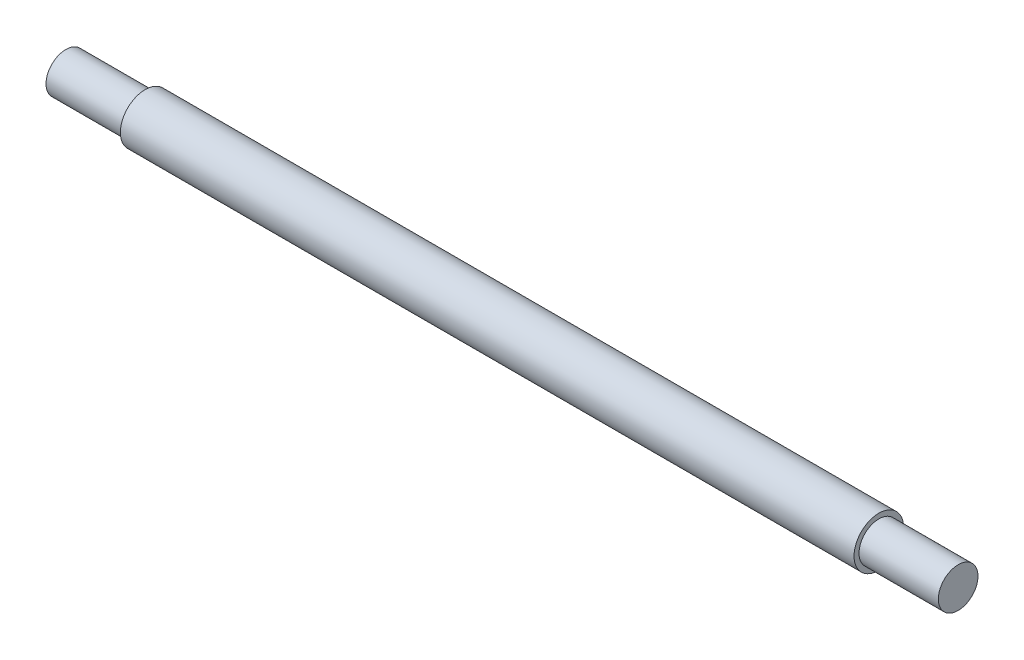
ISO-10303-21;
HEADER;
FILE_DESCRIPTION(('STEP AP214'),'2;1');
FILE_NAME('part.step','',(''),(''),'','','');
FILE_SCHEMA(('AUTOMOTIVE_DESIGN { 1 0 10303 214 1 1 1 1 }'));
ENDSEC;
DATA;
#1=APPLICATION_CONTEXT('core data for automotive mechanical design processes');
#2=APPLICATION_PROTOCOL_DEFINITION('international standard','automotive_design',2000,#1);
#3=PRODUCT_CONTEXT('',#1,'mechanical');
#4=PRODUCT('Part','Part','',(#3));
#5=PRODUCT_RELATED_PRODUCT_CATEGORY('part','',(#4));
#6=PRODUCT_DEFINITION_FORMATION('','',#4);
#7=PRODUCT_DEFINITION_CONTEXT('part definition',#1,'design');
#8=PRODUCT_DEFINITION('design','',#6,#7);
#9=PRODUCT_DEFINITION_SHAPE('','',#8);
#10=(LENGTH_UNIT() NAMED_UNIT(*) SI_UNIT(.MILLI.,.METRE.));
#11=(NAMED_UNIT(*) PLANE_ANGLE_UNIT() SI_UNIT($,.RADIAN.));
#12=(NAMED_UNIT(*) SI_UNIT($,.STERADIAN.) SOLID_ANGLE_UNIT());
#13=UNCERTAINTY_MEASURE_WITH_UNIT(LENGTH_MEASURE(1.E-05),#10,'distance_accuracy_value','');
#14=(GEOMETRIC_REPRESENTATION_CONTEXT(3) GLOBAL_UNCERTAINTY_ASSIGNED_CONTEXT((#13)) GLOBAL_UNIT_ASSIGNED_CONTEXT((#10,
#11,#12)) REPRESENTATION_CONTEXT('',''));
#15=CARTESIAN_POINT('',(0.,0.,0.));
#16=DIRECTION('',(0.,0.,1.));
#17=DIRECTION('',(1.,0.,0.));
#18=AXIS2_PLACEMENT_3D('',#15,#16,#17);
#19=CARTESIAN_POINT('',(45.,0.,0.));
#20=DIRECTION('',(-1.,0.,0.));
#21=DIRECTION('',(0.,0.,1.));
#22=AXIS2_PLACEMENT_3D('',#19,#20,#21);
#23=CYLINDRICAL_SURFACE('',#22,2.5);
#24=CARTESIAN_POINT('',(37.,0.,0.));
#25=DIRECTION('',(1.,0.,0.));
#26=DIRECTION('',(0.,0.,-1.));
#27=AXIS2_PLACEMENT_3D('',#24,#25,#26);
#28=CIRCLE('',#27,2.5);
#29=CARTESIAN_POINT('',(37.,0.,-2.5));
#30=VERTEX_POINT('',#29);
#31=EDGE_CURVE('E10',#30,#30,#28,.T.);
#32=ORIENTED_EDGE('',*,*,#31,.F.);
#33=EDGE_LOOP('',(#32));
#34=FACE_BOUND('',#33,.T.);
#35=CARTESIAN_POINT('',(-37.,0.,0.));
#36=DIRECTION('',(-1.,0.,0.));
#37=DIRECTION('',(0.,0.,1.));
#38=AXIS2_PLACEMENT_3D('',#35,#36,#37);
#39=CIRCLE('',#38,2.5);
#40=CARTESIAN_POINT('',(-37.,0.,2.5));
#41=VERTEX_POINT('',#40);
#42=EDGE_CURVE('E59',#41,#41,#39,.T.);
#43=ORIENTED_EDGE('',*,*,#42,.F.);
#44=EDGE_LOOP('',(#43));
#45=FACE_BOUND('',#44,.T.);
#46=ADVANCED_FACE('F41',(#34,#45),#23,.T.);
#47=CARTESIAN_POINT('',(37.,0.,0.));
#48=DIRECTION('',(1.,0.,0.));
#49=DIRECTION('',(0.,0.,-1.));
#50=AXIS2_PLACEMENT_3D('',#47,#48,#49);
#51=PLANE('',#50);
#52=CARTESIAN_POINT('',(37.,0.,0.));
#53=DIRECTION('',(1.,0.,0.));
#54=DIRECTION('',(0.,0.,-1.));
#55=AXIS2_PLACEMENT_3D('',#52,#53,#54);
#56=CIRCLE('',#55,2.);
#57=CARTESIAN_POINT('',(37.,0.,-2.));
#58=VERTEX_POINT('',#57);
#59=EDGE_CURVE('E48',#58,#58,#56,.T.);
#60=ORIENTED_EDGE('',*,*,#59,.F.);
#61=EDGE_LOOP('',(#60));
#62=FACE_BOUND('',#61,.T.);
#63=ORIENTED_EDGE('',*,*,#31,.T.);
#64=EDGE_LOOP('',(#63));
#65=FACE_BOUND('',#64,.T.);
#66=ADVANCED_FACE('F84',(#62,#65),#51,.T.);
#67=CARTESIAN_POINT('',(37.,0.,0.));
#68=DIRECTION('',(1.,0.,0.));
#69=DIRECTION('',(0.,0.,-1.));
#70=AXIS2_PLACEMENT_3D('',#67,#68,#69);
#71=CYLINDRICAL_SURFACE('',#70,2.);
#72=ORIENTED_EDGE('',*,*,#59,.T.);
#73=EDGE_LOOP('',(#72));
#74=FACE_BOUND('',#73,.T.);
#75=CARTESIAN_POINT('',(45.,0.,0.));
#76=DIRECTION('',(1.,0.,0.));
#77=DIRECTION('',(0.,0.,-1.));
#78=AXIS2_PLACEMENT_3D('',#75,#76,#77);
#79=CIRCLE('',#78,2.);
#80=CARTESIAN_POINT('',(45.,0.,-2.));
#81=VERTEX_POINT('',#80);
#82=EDGE_CURVE('E53',#81,#81,#79,.T.);
#83=ORIENTED_EDGE('',*,*,#82,.F.);
#84=EDGE_LOOP('',(#83));
#85=FACE_BOUND('',#84,.T.);
#86=ADVANCED_FACE('F89',(#74,#85),#71,.T.);
#87=CARTESIAN_POINT('',(45.,0.,0.));
#88=DIRECTION('',(1.,0.,0.));
#89=DIRECTION('',(0.,0.,-1.));
#90=AXIS2_PLACEMENT_3D('',#87,#88,#89);
#91=PLANE('',#90);
#92=ORIENTED_EDGE('',*,*,#82,.T.);
#93=EDGE_LOOP('',(#92));
#94=FACE_BOUND('',#93,.T.);
#95=ADVANCED_FACE('F79',(#94),#91,.T.);
#96=CARTESIAN_POINT('',(-37.,0.,0.));
#97=DIRECTION('',(-1.,0.,0.));
#98=DIRECTION('',(0.,0.,1.));
#99=AXIS2_PLACEMENT_3D('',#96,#97,#98);
#100=PLANE('',#99);
#101=CARTESIAN_POINT('',(-37.,0.,0.));
#102=DIRECTION('',(-1.,0.,0.));
#103=DIRECTION('',(0.,0.,1.));
#104=AXIS2_PLACEMENT_3D('',#101,#102,#103);
#105=CIRCLE('',#104,2.);
#106=CARTESIAN_POINT('',(-37.,0.,2.));
#107=VERTEX_POINT('',#106);
#108=EDGE_CURVE('E64',#107,#107,#105,.T.);
#109=ORIENTED_EDGE('',*,*,#108,.F.);
#110=EDGE_LOOP('',(#109));
#111=FACE_BOUND('',#110,.T.);
#112=ORIENTED_EDGE('',*,*,#42,.T.);
#113=EDGE_LOOP('',(#112));
#114=FACE_BOUND('',#113,.T.);
#115=ADVANCED_FACE('F76',(#111,#114),#100,.T.);
#116=CARTESIAN_POINT('',(-37.,0.,0.));
#117=DIRECTION('',(-1.,0.,0.));
#118=DIRECTION('',(0.,0.,1.));
#119=AXIS2_PLACEMENT_3D('',#116,#117,#118);
#120=CYLINDRICAL_SURFACE('',#119,2.);
#121=ORIENTED_EDGE('',*,*,#108,.T.);
#122=EDGE_LOOP('',(#121));
#123=FACE_BOUND('',#122,.T.);
#124=CARTESIAN_POINT('',(-45.,0.,0.));
#125=DIRECTION('',(-1.,0.,0.));
#126=DIRECTION('',(0.,0.,1.));
#127=AXIS2_PLACEMENT_3D('',#124,#125,#126);
#128=CIRCLE('',#127,2.);
#129=CARTESIAN_POINT('',(-45.,0.,2.));
#130=VERTEX_POINT('',#129);
#131=EDGE_CURVE('E65',#130,#130,#128,.T.);
#132=ORIENTED_EDGE('',*,*,#131,.F.);
#133=EDGE_LOOP('',(#132));
#134=FACE_BOUND('',#133,.T.);
#135=ADVANCED_FACE('F73',(#123,#134),#120,.T.);
#136=CARTESIAN_POINT('',(-45.,0.,0.));
#137=DIRECTION('',(1.,0.,0.));
#138=DIRECTION('',(0.,0.,-1.));
#139=AXIS2_PLACEMENT_3D('',#136,#137,#138);
#140=PLANE('',#139);
#141=ORIENTED_EDGE('',*,*,#131,.T.);
#142=EDGE_LOOP('',(#141));
#143=FACE_BOUND('',#142,.T.);
#144=ADVANCED_FACE('F99',(#143),#140,.F.);
#145=CLOSED_SHELL('',(#46,#66,#86,#95,#115,#135,#144));
#146=MANIFOLD_SOLID_BREP('B2',#145);
#147=ADVANCED_BREP_SHAPE_REPRESENTATION('',(#18,#146),#14);
#148=SHAPE_DEFINITION_REPRESENTATION(#9,#147);
ENDSEC;
END-ISO-10303-21;
